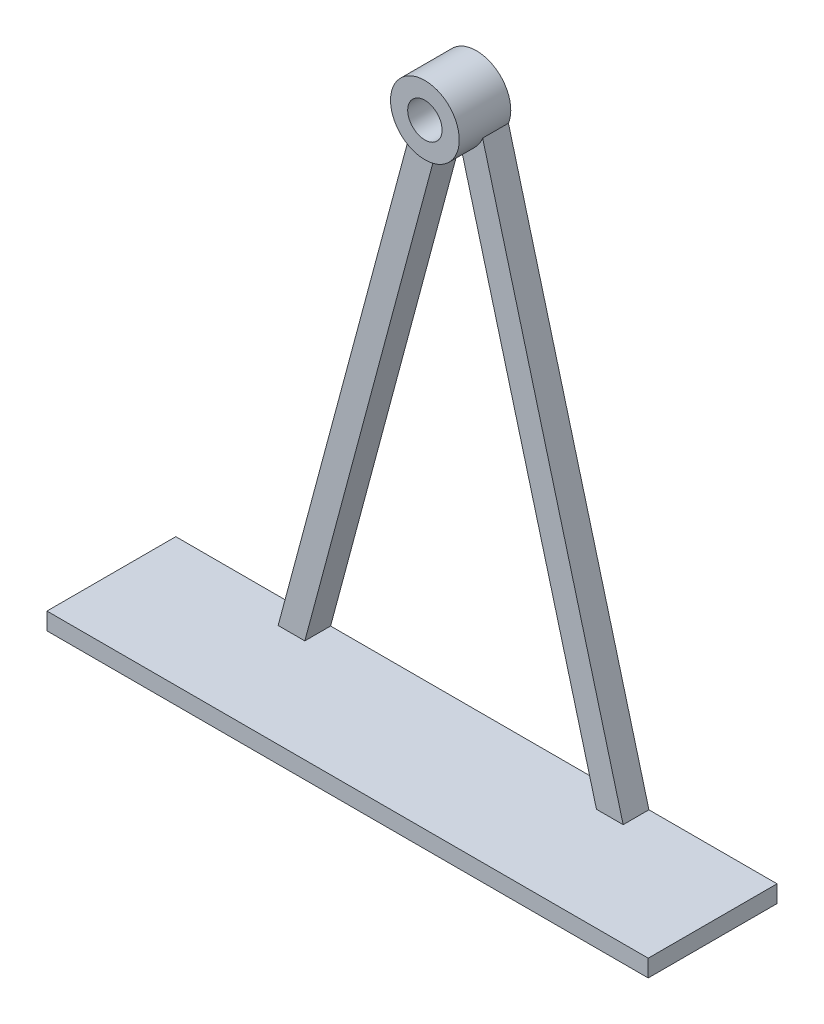
ISO-10303-21;
HEADER;
FILE_DESCRIPTION(('STEP AP214'),'2;1');
FILE_NAME('part.step','',(''),(''),'','','');
FILE_SCHEMA(('AUTOMOTIVE_DESIGN { 1 0 10303 214 1 1 1 1 }'));
ENDSEC;
DATA;
#1=APPLICATION_CONTEXT('core data for automotive mechanical design processes');
#2=APPLICATION_PROTOCOL_DEFINITION('international standard','automotive_design',2000,#1);
#3=PRODUCT_CONTEXT('',#1,'mechanical');
#4=PRODUCT('Part','Part','',(#3));
#5=PRODUCT_RELATED_PRODUCT_CATEGORY('part','',(#4));
#6=PRODUCT_DEFINITION_FORMATION('','',#4);
#7=PRODUCT_DEFINITION_CONTEXT('part definition',#1,'design');
#8=PRODUCT_DEFINITION('design','',#6,#7);
#9=PRODUCT_DEFINITION_SHAPE('','',#8);
#10=(LENGTH_UNIT() NAMED_UNIT(*) SI_UNIT(.MILLI.,.METRE.));
#11=(NAMED_UNIT(*) PLANE_ANGLE_UNIT() SI_UNIT($,.RADIAN.));
#12=(NAMED_UNIT(*) SI_UNIT($,.STERADIAN.) SOLID_ANGLE_UNIT());
#13=UNCERTAINTY_MEASURE_WITH_UNIT(LENGTH_MEASURE(1.E-05),#10,'distance_accuracy_value','');
#14=(GEOMETRIC_REPRESENTATION_CONTEXT(3) GLOBAL_UNCERTAINTY_ASSIGNED_CONTEXT((#13)) GLOBAL_UNIT_ASSIGNED_CONTEXT((#10,
#11,#12)) REPRESENTATION_CONTEXT('',''));
#15=CARTESIAN_POINT('',(0.,0.,0.));
#16=DIRECTION('',(0.,0.,1.));
#17=DIRECTION('',(1.,0.,0.));
#18=AXIS2_PLACEMENT_3D('',#15,#16,#17);
#19=CARTESIAN_POINT('',(0.,0.,12.));
#20=DIRECTION('',(0.,0.,1.));
#21=DIRECTION('',(1.,0.,0.));
#22=AXIS2_PLACEMENT_3D('',#19,#20,#21);
#23=PLANE('',#22);
#24=CARTESIAN_POINT('',(0.,0.,12.));
#25=DIRECTION('',(0.,0.,1.));
#26=DIRECTION('',(1.,0.,0.));
#27=AXIS2_PLACEMENT_3D('',#24,#25,#26);
#28=CIRCLE('',#27,8.);
#29=CARTESIAN_POINT('',(8.,0.,12.));
#30=VERTEX_POINT('',#29);
#31=EDGE_CURVE('E12',#30,#30,#28,.T.);
#32=ORIENTED_EDGE('',*,*,#31,.T.);
#33=EDGE_LOOP('',(#32));
#34=FACE_BOUND('',#33,.T.);
#35=CARTESIAN_POINT('',(0.,0.,12.));
#36=DIRECTION('',(0.,0.,1.));
#37=DIRECTION('',(1.,0.,0.));
#38=AXIS2_PLACEMENT_3D('',#35,#36,#37);
#39=CIRCLE('',#38,4.);
#40=CARTESIAN_POINT('',(4.,0.,12.));
#41=VERTEX_POINT('',#40);
#42=EDGE_CURVE('E214',#41,#41,#39,.T.);
#43=ORIENTED_EDGE('',*,*,#42,.F.);
#44=EDGE_LOOP('',(#43));
#45=FACE_BOUND('',#44,.T.);
#46=ADVANCED_FACE('F42',(#34,#45),#23,.T.);
#47=CARTESIAN_POINT('',(0.,0.,0.));
#48=DIRECTION('',(0.,0.,1.));
#49=DIRECTION('',(1.,0.,0.));
#50=AXIS2_PLACEMENT_3D('',#47,#48,#49);
#51=PLANE('',#50);
#52=DIRECTION('',(0.258819045102524,0.965925826289067,0.));
#53=VECTOR('',#52,1.);
#54=CARTESIAN_POINT('',(-0.432696235534194,0.115940606879376,0.));
#55=LINE('',#54,#53);
#56=CARTESIAN_POINT('',(-33.9574114814083,-125.,0.));
#57=VERTEX_POINT('',#56);
#58=CARTESIAN_POINT('',(-2.50000000000001,-7.59934207678533,0.));
#59=VERTEX_POINT('',#58);
#60=EDGE_CURVE('E190',#57,#59,#55,.T.);
#61=ORIENTED_EDGE('',*,*,#60,.F.);
#62=DIRECTION('',(1.,0.,0.));
#63=VECTOR('',#62,1.);
#64=CARTESIAN_POINT('',(70.,-125.,0.));
#65=LINE('',#64,#63);
#66=CARTESIAN_POINT('',(33.9574114814083,-125.,0.));
#67=VERTEX_POINT('',#66);
#68=EDGE_CURVE('E260',#57,#67,#65,.T.);
#69=ORIENTED_EDGE('',*,*,#68,.T.);
#70=DIRECTION('',(-0.258819045102524,0.965925826289067,0.));
#71=VECTOR('',#70,1.);
#72=CARTESIAN_POINT('',(0.432696235534194,0.115940606879376,0.));
#73=LINE('',#72,#71);
#74=CARTESIAN_POINT('',(2.50000000000001,-7.59934207678533,0.));
#75=VERTEX_POINT('',#74);
#76=EDGE_CURVE('E172',#67,#75,#73,.T.);
#77=ORIENTED_EDGE('',*,*,#76,.T.);
#78=CARTESIAN_POINT('',(0.,0.,0.));
#79=DIRECTION('',(0.,0.,1.));
#80=DIRECTION('',(1.,0.,0.));
#81=AXIS2_PLACEMENT_3D('',#78,#79,#80);
#82=CIRCLE('',#81,8.);
#83=EDGE_CURVE('E46',#59,#75,#82,.T.);
#84=ORIENTED_EDGE('',*,*,#83,.F.);
#85=EDGE_LOOP('',(#61,#69,#77,#84));
#86=FACE_BOUND('',#85,.T.);
#87=CARTESIAN_POINT('',(-70.,-125.,0.));
#88=VERTEX_POINT('',#87);
#89=CARTESIAN_POINT('',(-40.1690685638688,-125.,0.));
#90=VERTEX_POINT('',#89);
#91=EDGE_CURVE('E257',#88,#90,#65,.T.);
#92=ORIENTED_EDGE('',*,*,#91,.T.);
#93=DIRECTION('',(0.258819045102524,0.965925826289067,0.));
#94=VECTOR('',#93,1.);
#95=CARTESIAN_POINT('',(-6.2282511932686,1.66885487749452,0.));
#96=LINE('',#95,#94);
#97=CARTESIAN_POINT('',(-7.45385736033893,-2.90516960808163,0.));
#98=VERTEX_POINT('',#97);
#99=EDGE_CURVE('E192',#90,#98,#96,.T.);
#100=ORIENTED_EDGE('',*,*,#99,.T.);
#101=CARTESIAN_POINT('',(7.45385736033893,-2.90516960808163,0.));
#102=VERTEX_POINT('',#101);
#103=EDGE_CURVE('E217',#102,#98,#82,.T.);
#104=ORIENTED_EDGE('',*,*,#103,.F.);
#105=DIRECTION('',(-0.258819045102524,0.965925826289067,0.));
#106=VECTOR('',#105,1.);
#107=CARTESIAN_POINT('',(6.2282511932686,1.66885487749452,0.));
#108=LINE('',#107,#106);
#109=CARTESIAN_POINT('',(40.1690685638688,-125.,0.));
#110=VERTEX_POINT('',#109);
#111=EDGE_CURVE('E170',#110,#102,#108,.T.);
#112=ORIENTED_EDGE('',*,*,#111,.F.);
#113=CARTESIAN_POINT('',(70.,-125.,0.));
#114=VERTEX_POINT('',#113);
#115=EDGE_CURVE('E262',#110,#114,#65,.T.);
#116=ORIENTED_EDGE('',*,*,#115,.T.);
#117=DIRECTION('',(0.,1.,0.));
#118=VECTOR('',#117,1.);
#119=CARTESIAN_POINT('',(70.,-129.,0.));
#120=LINE('',#119,#118);
#121=CARTESIAN_POINT('',(70.,-129.,0.));
#122=VERTEX_POINT('',#121);
#123=EDGE_CURVE('E143',#122,#114,#120,.T.);
#124=ORIENTED_EDGE('',*,*,#123,.F.);
#125=DIRECTION('',(1.,0.,0.));
#126=VECTOR('',#125,1.);
#127=CARTESIAN_POINT('',(70.,-129.,0.));
#128=LINE('',#127,#126);
#129=CARTESIAN_POINT('',(-70.,-129.,0.));
#130=VERTEX_POINT('',#129);
#131=EDGE_CURVE('E134',#130,#122,#128,.T.);
#132=ORIENTED_EDGE('',*,*,#131,.F.);
#133=DIRECTION('',(0.,1.,0.));
#134=VECTOR('',#133,1.);
#135=CARTESIAN_POINT('',(-70.,-129.,0.));
#136=LINE('',#135,#134);
#137=EDGE_CURVE('E140',#130,#88,#136,.T.);
#138=ORIENTED_EDGE('',*,*,#137,.T.);
#139=EDGE_LOOP('',(#92,#100,#104,#112,#116,#124,#132,#138));
#140=FACE_BOUND('',#139,.T.);
#141=CARTESIAN_POINT('',(0.,0.,0.));
#142=DIRECTION('',(0.,0.,1.));
#143=DIRECTION('',(1.,0.,0.));
#144=AXIS2_PLACEMENT_3D('',#141,#142,#143);
#145=CIRCLE('',#144,4.);
#146=CARTESIAN_POINT('',(4.,0.,0.));
#147=VERTEX_POINT('',#146);
#148=EDGE_CURVE('E205',#147,#147,#145,.T.);
#149=ORIENTED_EDGE('',*,*,#148,.T.);
#150=EDGE_LOOP('',(#149));
#151=FACE_BOUND('',#150,.T.);
#152=ADVANCED_FACE('F137',(#86,#140,#151),#51,.F.);
#153=CARTESIAN_POINT('',(0.,0.,12.));
#154=DIRECTION('',(0.,0.,-1.));
#155=DIRECTION('',(-1.,0.,0.));
#156=AXIS2_PLACEMENT_3D('',#153,#154,#155);
#157=CYLINDRICAL_SURFACE('',#156,8.);
#158=ORIENTED_EDGE('',*,*,#31,.F.);
#159=EDGE_LOOP('',(#158));
#160=FACE_BOUND('',#159,.T.);
#161=ORIENTED_EDGE('',*,*,#83,.T.);
#162=DIRECTION('',(0.,0.,-1.));
#163=VECTOR('',#162,1.);
#164=CARTESIAN_POINT('',(2.50000000000001,-7.59934207678533,139.773652741482));
#165=LINE('',#164,#163);
#166=CARTESIAN_POINT('',(2.50000000000001,-7.59934207678533,6.00000000000001));
#167=VERTEX_POINT('',#166);
#168=EDGE_CURVE('E180',#167,#75,#165,.T.);
#169=ORIENTED_EDGE('',*,*,#168,.F.);
#170=CARTESIAN_POINT('',(0.,0.,6.00000000000001));
#171=DIRECTION('',(0.,0.,1.));
#172=DIRECTION('',(1.,0.,0.));
#173=AXIS2_PLACEMENT_3D('',#170,#171,#172);
#174=CIRCLE('',#173,8.);
#175=CARTESIAN_POINT('',(7.45385736033893,-2.90516960808164,6.));
#176=VERTEX_POINT('',#175);
#177=EDGE_CURVE('E182',#176,#167,#174,.F.);
#178=ORIENTED_EDGE('',*,*,#177,.F.);
#179=DIRECTION('',(0.,0.,-1.));
#180=VECTOR('',#179,1.);
#181=CARTESIAN_POINT('',(7.45385736033893,-2.90516960808163,139.773652741482));
#182=LINE('',#181,#180);
#183=EDGE_CURVE('E161',#176,#102,#182,.T.);
#184=ORIENTED_EDGE('',*,*,#183,.T.);
#185=ORIENTED_EDGE('',*,*,#103,.T.);
#186=DIRECTION('',(0.,0.,-1.));
#187=VECTOR('',#186,1.);
#188=CARTESIAN_POINT('',(-7.45385736033893,-2.90516960808163,139.773652741482));
#189=LINE('',#188,#187);
#190=CARTESIAN_POINT('',(-7.45385736033893,-2.90516960808163,6.00000000000001));
#191=VERTEX_POINT('',#190);
#192=EDGE_CURVE('E200',#191,#98,#189,.T.);
#193=ORIENTED_EDGE('',*,*,#192,.F.);
#194=CARTESIAN_POINT('',(0.,0.,6.00000000000001));
#195=DIRECTION('',(0.,0.,1.));
#196=DIRECTION('',(1.,0.,0.));
#197=AXIS2_PLACEMENT_3D('',#194,#195,#196);
#198=CIRCLE('',#197,8.);
#199=CARTESIAN_POINT('',(-2.50000000000001,-7.59934207678533,6.));
#200=VERTEX_POINT('',#199);
#201=EDGE_CURVE('E184',#191,#200,#198,.T.);
#202=ORIENTED_EDGE('',*,*,#201,.T.);
#203=DIRECTION('',(0.,0.,-1.));
#204=VECTOR('',#203,1.);
#205=CARTESIAN_POINT('',(-2.50000000000001,-7.59934207678533,139.773652741482));
#206=LINE('',#205,#204);
#207=EDGE_CURVE('E201',#200,#59,#206,.T.);
#208=ORIENTED_EDGE('',*,*,#207,.T.);
#209=EDGE_LOOP('',(#161,#169,#178,#184,#185,#193,#202,#208));
#210=FACE_BOUND('',#209,.T.);
#211=ADVANCED_FACE('F44',(#160,#210),#157,.T.);
#212=CARTESIAN_POINT('',(0.,0.,12.));
#213=DIRECTION('',(0.,0.,-1.));
#214=DIRECTION('',(-1.,0.,0.));
#215=AXIS2_PLACEMENT_3D('',#212,#213,#214);
#216=CYLINDRICAL_SURFACE('',#215,4.);
#217=ORIENTED_EDGE('',*,*,#42,.T.);
#218=EDGE_LOOP('',(#217));
#219=FACE_BOUND('',#218,.T.);
#220=ORIENTED_EDGE('',*,*,#148,.F.);
#221=EDGE_LOOP('',(#220));
#222=FACE_BOUND('',#221,.T.);
#223=ADVANCED_FACE('F221',(#219,#222),#216,.F.);
#224=CARTESIAN_POINT('',(-6.2282511932686,1.66885487749452,139.773652741482));
#225=DIRECTION('',(-0.965925826289067,0.258819045102524,0.));
#226=DIRECTION('',(-0.258819045102524,-0.965925826289067,0.));
#227=AXIS2_PLACEMENT_3D('',#224,#225,#226);
#228=PLANE('',#227);
#229=DIRECTION('',(0.,0.,-1.));
#230=VECTOR('',#229,1.);
#231=CARTESIAN_POINT('',(-40.1690685638688,-125.,139.773652741482));
#232=LINE('',#231,#230);
#233=CARTESIAN_POINT('',(-40.1690685638688,-125.,6.));
#234=VERTEX_POINT('',#233);
#235=EDGE_CURVE('E208',#234,#90,#232,.T.);
#236=ORIENTED_EDGE('',*,*,#235,.F.);
#237=DIRECTION('',(0.258819045102524,0.965925826289067,0.));
#238=VECTOR('',#237,1.);
#239=CARTESIAN_POINT('',(-6.2282511932686,1.66885487749452,6.00000000000001));
#240=LINE('',#239,#238);
#241=EDGE_CURVE('E198',#234,#191,#240,.T.);
#242=ORIENTED_EDGE('',*,*,#241,.T.);
#243=ORIENTED_EDGE('',*,*,#192,.T.);
#244=ORIENTED_EDGE('',*,*,#99,.F.);
#245=EDGE_LOOP('',(#236,#242,#243,#244));
#246=FACE_BOUND('',#245,.T.);
#247=ADVANCED_FACE('F223',(#246),#228,.T.);
#248=CARTESIAN_POINT('',(-0.432696235534194,0.115940606879376,139.773652741482));
#249=DIRECTION('',(-0.965925826289067,0.258819045102524,0.));
#250=DIRECTION('',(-0.258819045102524,-0.965925826289067,0.));
#251=AXIS2_PLACEMENT_3D('',#248,#249,#250);
#252=PLANE('',#251);
#253=DIRECTION('',(0.258819045102524,0.965925826289067,0.));
#254=VECTOR('',#253,1.);
#255=CARTESIAN_POINT('',(-0.432696235534194,0.115940606879376,6.00000000000001));
#256=LINE('',#255,#254);
#257=CARTESIAN_POINT('',(-33.9574114814083,-125.,6.00000000000001));
#258=VERTEX_POINT('',#257);
#259=EDGE_CURVE('E65',#258,#200,#256,.T.);
#260=ORIENTED_EDGE('',*,*,#259,.F.);
#261=DIRECTION('',(0.,0.,-1.));
#262=VECTOR('',#261,1.);
#263=CARTESIAN_POINT('',(-33.9574114814083,-125.,139.773652741482));
#264=LINE('',#263,#262);
#265=EDGE_CURVE('E193',#258,#57,#264,.T.);
#266=ORIENTED_EDGE('',*,*,#265,.T.);
#267=ORIENTED_EDGE('',*,*,#60,.T.);
#268=ORIENTED_EDGE('',*,*,#207,.F.);
#269=EDGE_LOOP('',(#260,#266,#267,#268));
#270=FACE_BOUND('',#269,.T.);
#271=ADVANCED_FACE('F230',(#270),#252,.F.);
#272=CARTESIAN_POINT('',(0.,0.,6.));
#273=DIRECTION('',(0.,0.,1.));
#274=DIRECTION('',(1.,0.,0.));
#275=AXIS2_PLACEMENT_3D('',#272,#273,#274);
#276=PLANE('',#275);
#277=ORIENTED_EDGE('',*,*,#201,.F.);
#278=ORIENTED_EDGE('',*,*,#241,.F.);
#279=DIRECTION('',(1.,0.,0.));
#280=VECTOR('',#279,1.);
#281=CARTESIAN_POINT('',(0.,-125.,6.00000000000001));
#282=LINE('',#281,#280);
#283=EDGE_CURVE('E196',#234,#258,#282,.T.);
#284=ORIENTED_EDGE('',*,*,#283,.T.);
#285=ORIENTED_EDGE('',*,*,#259,.T.);
#286=EDGE_LOOP('',(#277,#278,#284,#285));
#287=FACE_BOUND('',#286,.T.);
#288=ADVANCED_FACE('F289',(#287),#276,.T.);
#289=CARTESIAN_POINT('',(0.432696235534194,0.115940606879376,139.773652741482));
#290=DIRECTION('',(-0.965925826289067,-0.258819045102524,0.));
#291=DIRECTION('',(0.258819045102524,-0.965925826289067,0.));
#292=AXIS2_PLACEMENT_3D('',#289,#290,#291);
#293=PLANE('',#292);
#294=DIRECTION('',(0.,0.,-1.));
#295=VECTOR('',#294,1.);
#296=CARTESIAN_POINT('',(33.9574114814083,-125.,139.773652741482));
#297=LINE('',#296,#295);
#298=CARTESIAN_POINT('',(33.9574114814083,-125.,6.));
#299=VERTEX_POINT('',#298);
#300=EDGE_CURVE('E179',#299,#67,#297,.T.);
#301=ORIENTED_EDGE('',*,*,#300,.F.);
#302=DIRECTION('',(-0.258819045102524,0.965925826289067,0.));
#303=VECTOR('',#302,1.);
#304=CARTESIAN_POINT('',(0.432696235534194,0.115940606879376,6.00000000000001));
#305=LINE('',#304,#303);
#306=EDGE_CURVE('E164',#299,#167,#305,.T.);
#307=ORIENTED_EDGE('',*,*,#306,.T.);
#308=ORIENTED_EDGE('',*,*,#168,.T.);
#309=ORIENTED_EDGE('',*,*,#76,.F.);
#310=EDGE_LOOP('',(#301,#307,#308,#309));
#311=FACE_BOUND('',#310,.T.);
#312=ADVANCED_FACE('F287',(#311),#293,.T.);
#313=CARTESIAN_POINT('',(6.2282511932686,1.66885487749452,139.773652741482));
#314=DIRECTION('',(-0.965925826289067,-0.258819045102524,0.));
#315=DIRECTION('',(0.258819045102524,-0.965925826289067,0.));
#316=AXIS2_PLACEMENT_3D('',#313,#314,#315);
#317=PLANE('',#316);
#318=DIRECTION('',(-0.258819045102524,0.965925826289067,0.));
#319=VECTOR('',#318,1.);
#320=CARTESIAN_POINT('',(6.2282511932686,1.66885487749452,6.00000000000001));
#321=LINE('',#320,#319);
#322=CARTESIAN_POINT('',(40.1690685638688,-125.,6.00000000000001));
#323=VERTEX_POINT('',#322);
#324=EDGE_CURVE('E57',#323,#176,#321,.T.);
#325=ORIENTED_EDGE('',*,*,#324,.F.);
#326=DIRECTION('',(0.,0.,-1.));
#327=VECTOR('',#326,1.);
#328=CARTESIAN_POINT('',(40.1690685638688,-125.,139.773652741482));
#329=LINE('',#328,#327);
#330=EDGE_CURVE('E173',#323,#110,#329,.T.);
#331=ORIENTED_EDGE('',*,*,#330,.T.);
#332=ORIENTED_EDGE('',*,*,#111,.T.);
#333=ORIENTED_EDGE('',*,*,#183,.F.);
#334=EDGE_LOOP('',(#325,#331,#332,#333));
#335=FACE_BOUND('',#334,.T.);
#336=ADVANCED_FACE('F283',(#335),#317,.F.);
#337=CARTESIAN_POINT('',(0.,0.,6.));
#338=DIRECTION('',(0.,0.,1.));
#339=DIRECTION('',(1.,0.,0.));
#340=AXIS2_PLACEMENT_3D('',#337,#338,#339);
#341=PLANE('',#340);
#342=ORIENTED_EDGE('',*,*,#324,.T.);
#343=ORIENTED_EDGE('',*,*,#177,.T.);
#344=ORIENTED_EDGE('',*,*,#306,.F.);
#345=DIRECTION('',(-1.,0.,0.));
#346=VECTOR('',#345,1.);
#347=CARTESIAN_POINT('',(0.,-125.,6.00000000000001));
#348=LINE('',#347,#346);
#349=EDGE_CURVE('E176',#323,#299,#348,.T.);
#350=ORIENTED_EDGE('',*,*,#349,.F.);
#351=EDGE_LOOP('',(#342,#343,#344,#350));
#352=FACE_BOUND('',#351,.T.);
#353=ADVANCED_FACE('F284',(#352),#341,.T.);
#354=CARTESIAN_POINT('',(-70.,-129.,0.));
#355=DIRECTION('',(1.,0.,0.));
#356=DIRECTION('',(0.,0.,-1.));
#357=AXIS2_PLACEMENT_3D('',#354,#355,#356);
#358=PLANE('',#357);
#359=DIRECTION('',(0.,0.,-1.));
#360=VECTOR('',#359,1.);
#361=CARTESIAN_POINT('',(-70.,-125.,0.));
#362=LINE('',#361,#360);
#363=CARTESIAN_POINT('',(-70.,-125.,30.));
#364=VERTEX_POINT('',#363);
#365=EDGE_CURVE('E160',#364,#88,#362,.T.);
#366=ORIENTED_EDGE('',*,*,#365,.T.);
#367=ORIENTED_EDGE('',*,*,#137,.F.);
#368=DIRECTION('',(0.,0.,-1.));
#369=VECTOR('',#368,1.);
#370=CARTESIAN_POINT('',(-70.,-129.,0.));
#371=LINE('',#370,#369);
#372=CARTESIAN_POINT('',(-70.,-129.,30.));
#373=VERTEX_POINT('',#372);
#374=EDGE_CURVE('E147',#373,#130,#371,.T.);
#375=ORIENTED_EDGE('',*,*,#374,.F.);
#376=DIRECTION('',(0.,1.,0.));
#377=VECTOR('',#376,1.);
#378=CARTESIAN_POINT('',(-70.,-129.,30.));
#379=LINE('',#378,#377);
#380=EDGE_CURVE('E269',#373,#364,#379,.T.);
#381=ORIENTED_EDGE('',*,*,#380,.T.);
#382=EDGE_LOOP('',(#366,#367,#375,#381));
#383=FACE_BOUND('',#382,.T.);
#384=ADVANCED_FACE('F158',(#383),#358,.F.);
#385=CARTESIAN_POINT('',(70.,-129.,30.));
#386=DIRECTION('',(-1.,0.,0.));
#387=DIRECTION('',(0.,0.,1.));
#388=AXIS2_PLACEMENT_3D('',#385,#386,#387);
#389=PLANE('',#388);
#390=DIRECTION('',(0.,0.,1.));
#391=VECTOR('',#390,1.);
#392=CARTESIAN_POINT('',(70.,-125.,30.));
#393=LINE('',#392,#391);
#394=CARTESIAN_POINT('',(70.,-125.,30.));
#395=VERTEX_POINT('',#394);
#396=EDGE_CURVE('E259',#114,#395,#393,.T.);
#397=ORIENTED_EDGE('',*,*,#396,.T.);
#398=DIRECTION('',(0.,1.,0.));
#399=VECTOR('',#398,1.);
#400=CARTESIAN_POINT('',(70.,-129.,30.));
#401=LINE('',#400,#399);
#402=CARTESIAN_POINT('',(70.,-129.,30.));
#403=VERTEX_POINT('',#402);
#404=EDGE_CURVE('E166',#403,#395,#401,.T.);
#405=ORIENTED_EDGE('',*,*,#404,.F.);
#406=DIRECTION('',(0.,0.,1.));
#407=VECTOR('',#406,1.);
#408=CARTESIAN_POINT('',(70.,-129.,30.));
#409=LINE('',#408,#407);
#410=EDGE_CURVE('E146',#122,#403,#409,.T.);
#411=ORIENTED_EDGE('',*,*,#410,.F.);
#412=ORIENTED_EDGE('',*,*,#123,.T.);
#413=EDGE_LOOP('',(#397,#405,#411,#412));
#414=FACE_BOUND('',#413,.T.);
#415=ADVANCED_FACE('F273',(#414),#389,.F.);
#416=CARTESIAN_POINT('',(-70.,-129.,30.));
#417=DIRECTION('',(0.,0.,-1.));
#418=DIRECTION('',(-1.,0.,0.));
#419=AXIS2_PLACEMENT_3D('',#416,#417,#418);
#420=PLANE('',#419);
#421=DIRECTION('',(-1.,0.,0.));
#422=VECTOR('',#421,1.);
#423=CARTESIAN_POINT('',(-70.,-125.,30.));
#424=LINE('',#423,#422);
#425=EDGE_CURVE('E156',#395,#364,#424,.T.);
#426=ORIENTED_EDGE('',*,*,#425,.T.);
#427=ORIENTED_EDGE('',*,*,#380,.F.);
#428=DIRECTION('',(-1.,0.,0.));
#429=VECTOR('',#428,1.);
#430=CARTESIAN_POINT('',(-70.,-129.,30.));
#431=LINE('',#430,#429);
#432=EDGE_CURVE('E152',#403,#373,#431,.T.);
#433=ORIENTED_EDGE('',*,*,#432,.F.);
#434=ORIENTED_EDGE('',*,*,#404,.T.);
#435=EDGE_LOOP('',(#426,#427,#433,#434));
#436=FACE_BOUND('',#435,.T.);
#437=ADVANCED_FACE('F277',(#436),#420,.F.);
#438=CARTESIAN_POINT('',(0.,-129.,0.));
#439=DIRECTION('',(0.,1.,0.));
#440=DIRECTION('',(0.,0.,1.));
#441=AXIS2_PLACEMENT_3D('',#438,#439,#440);
#442=PLANE('',#441);
#443=ORIENTED_EDGE('',*,*,#374,.T.);
#444=ORIENTED_EDGE('',*,*,#131,.T.);
#445=ORIENTED_EDGE('',*,*,#410,.T.);
#446=ORIENTED_EDGE('',*,*,#432,.T.);
#447=EDGE_LOOP('',(#443,#444,#445,#446));
#448=FACE_BOUND('',#447,.T.);
#449=ADVANCED_FACE('F150',(#448),#442,.F.);
#450=CARTESIAN_POINT('',(0.,-125.,0.));
#451=DIRECTION('',(0.,1.,0.));
#452=DIRECTION('',(0.,0.,1.));
#453=AXIS2_PLACEMENT_3D('',#450,#451,#452);
#454=PLANE('',#453);
#455=ORIENTED_EDGE('',*,*,#283,.F.);
#456=ORIENTED_EDGE('',*,*,#235,.T.);
#457=ORIENTED_EDGE('',*,*,#91,.F.);
#458=ORIENTED_EDGE('',*,*,#365,.F.);
#459=ORIENTED_EDGE('',*,*,#425,.F.);
#460=ORIENTED_EDGE('',*,*,#396,.F.);
#461=ORIENTED_EDGE('',*,*,#115,.F.);
#462=ORIENTED_EDGE('',*,*,#330,.F.);
#463=ORIENTED_EDGE('',*,*,#349,.T.);
#464=ORIENTED_EDGE('',*,*,#300,.T.);
#465=ORIENTED_EDGE('',*,*,#68,.F.);
#466=ORIENTED_EDGE('',*,*,#265,.F.);
#467=EDGE_LOOP('',(#455,#456,#457,#458,#459,#460,#461,#462,#463,#464,#465,#466));
#468=FACE_BOUND('',#467,.T.);
#469=ADVANCED_FACE('F280',(#468),#454,.T.);
#470=CLOSED_SHELL('',(#46,#152,#211,#223,#247,#271,#288,#312,#336,#353,#384,#415,#437,#449,#469));
#471=MANIFOLD_SOLID_BREP('B2',#470);
#472=ADVANCED_BREP_SHAPE_REPRESENTATION('',(#18,#471),#14);
#473=SHAPE_DEFINITION_REPRESENTATION(#9,#472);
ENDSEC;
END-ISO-10303-21;
